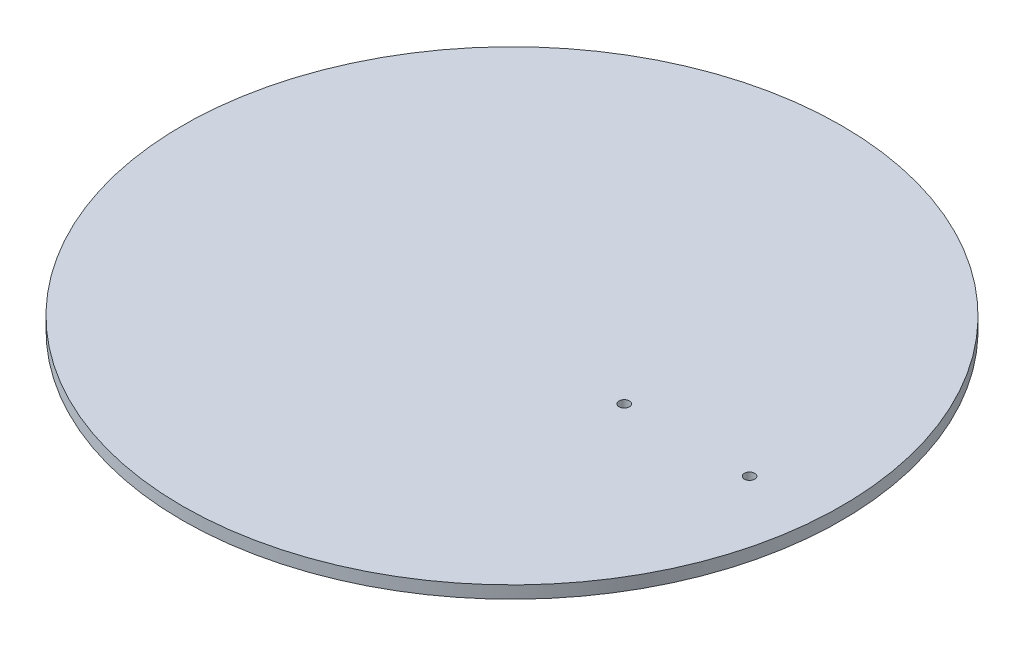
ISO-10303-21;
HEADER;
FILE_DESCRIPTION(('STEP AP214'),'2;1');
FILE_NAME('part.step','',(''),(''),'','','');
FILE_SCHEMA(('AUTOMOTIVE_DESIGN { 1 0 10303 214 1 1 1 1 }'));
ENDSEC;
DATA;
#1=APPLICATION_CONTEXT('core data for automotive mechanical design processes');
#2=APPLICATION_PROTOCOL_DEFINITION('international standard','automotive_design',2000,#1);
#3=PRODUCT_CONTEXT('',#1,'mechanical');
#4=PRODUCT('Part','Part','',(#3));
#5=PRODUCT_RELATED_PRODUCT_CATEGORY('part','',(#4));
#6=PRODUCT_DEFINITION_FORMATION('','',#4);
#7=PRODUCT_DEFINITION_CONTEXT('part definition',#1,'design');
#8=PRODUCT_DEFINITION('design','',#6,#7);
#9=PRODUCT_DEFINITION_SHAPE('','',#8);
#10=(LENGTH_UNIT() NAMED_UNIT(*) SI_UNIT(.MILLI.,.METRE.));
#11=(NAMED_UNIT(*) PLANE_ANGLE_UNIT() SI_UNIT($,.RADIAN.));
#12=(NAMED_UNIT(*) SI_UNIT($,.STERADIAN.) SOLID_ANGLE_UNIT());
#13=UNCERTAINTY_MEASURE_WITH_UNIT(LENGTH_MEASURE(1.E-05),#10,'distance_accuracy_value','');
#14=(GEOMETRIC_REPRESENTATION_CONTEXT(3) GLOBAL_UNCERTAINTY_ASSIGNED_CONTEXT((#13)) GLOBAL_UNIT_ASSIGNED_CONTEXT((#10,
#11,#12)) REPRESENTATION_CONTEXT('',''));
#15=CARTESIAN_POINT('',(0.,0.,0.));
#16=DIRECTION('',(0.,0.,1.));
#17=DIRECTION('',(1.,0.,0.));
#18=AXIS2_PLACEMENT_3D('',#15,#16,#17);
#19=CARTESIAN_POINT('',(40.7795689405013,2.54,74.952013207777));
#20=DIRECTION('',(0.,-1.,0.));
#21=DIRECTION('',(0.,0.,-1.));
#22=AXIS2_PLACEMENT_3D('',#19,#20,#21);
#23=CYLINDRICAL_SURFACE('',#22,1.05429477609715);
#24=CARTESIAN_POINT('',(40.7795689405013,2.54,74.952013207777));
#25=DIRECTION('',(0.,1.,0.));
#26=DIRECTION('',(0.,0.,1.));
#27=AXIS2_PLACEMENT_3D('',#24,#25,#26);
#28=CIRCLE('',#27,1.05429477609715);
#29=CARTESIAN_POINT('',(40.7795689405013,2.54,76.0063079838742));
#30=VERTEX_POINT('',#29);
#31=EDGE_CURVE('E41',#30,#30,#28,.T.);
#32=ORIENTED_EDGE('',*,*,#31,.T.);
#33=EDGE_LOOP('',(#32));
#34=FACE_BOUND('',#33,.T.);
#35=CARTESIAN_POINT('',(40.7795689405013,0.,74.952013207777));
#36=DIRECTION('',(0.,1.,0.));
#37=DIRECTION('',(0.,0.,1.));
#38=AXIS2_PLACEMENT_3D('',#35,#36,#37);
#39=CIRCLE('',#38,1.05429477609715);
#40=CARTESIAN_POINT('',(40.7795689405013,0.,76.0063079838742));
#41=VERTEX_POINT('',#40);
#42=EDGE_CURVE('E52',#41,#41,#39,.T.);
#43=ORIENTED_EDGE('',*,*,#42,.F.);
#44=EDGE_LOOP('',(#43));
#45=FACE_BOUND('',#44,.T.);
#46=ADVANCED_FACE('F33',(#34,#45),#23,.F.);
#47=CARTESIAN_POINT('',(66.3720586462217,2.54,74.952013207777));
#48=DIRECTION('',(0.,-1.,0.));
#49=DIRECTION('',(0.,0.,-1.));
#50=AXIS2_PLACEMENT_3D('',#47,#48,#49);
#51=CYLINDRICAL_SURFACE('',#50,1.05429477609715);
#52=CARTESIAN_POINT('',(66.3720586462217,2.54,74.952013207777));
#53=DIRECTION('',(0.,1.,0.));
#54=DIRECTION('',(0.,0.,1.));
#55=AXIS2_PLACEMENT_3D('',#52,#53,#54);
#56=CIRCLE('',#55,1.05429477609715);
#57=CARTESIAN_POINT('',(66.3720586462217,2.54,76.0063079838742));
#58=VERTEX_POINT('',#57);
#59=EDGE_CURVE('E46',#58,#58,#56,.T.);
#60=ORIENTED_EDGE('',*,*,#59,.T.);
#61=EDGE_LOOP('',(#60));
#62=FACE_BOUND('',#61,.T.);
#63=CARTESIAN_POINT('',(66.3720586462217,0.,74.952013207777));
#64=DIRECTION('',(0.,1.,0.));
#65=DIRECTION('',(0.,0.,1.));
#66=AXIS2_PLACEMENT_3D('',#63,#64,#65);
#67=CIRCLE('',#66,1.05429477609715);
#68=CARTESIAN_POINT('',(66.3720586462217,0.,76.0063079838742));
#69=VERTEX_POINT('',#68);
#70=EDGE_CURVE('E50',#69,#69,#67,.T.);
#71=ORIENTED_EDGE('',*,*,#70,.F.);
#72=EDGE_LOOP('',(#71));
#73=FACE_BOUND('',#72,.T.);
#74=ADVANCED_FACE('F35',(#62,#73),#51,.F.);
#75=CARTESIAN_POINT('',(13.7432890350295,2.54,70.8415877079415));
#76=DIRECTION('',(0.,-1.,0.));
#77=DIRECTION('',(0.,0.,-1.));
#78=AXIS2_PLACEMENT_3D('',#75,#76,#77);
#79=CYLINDRICAL_SURFACE('',#78,67.31);
#80=CARTESIAN_POINT('',(13.7432890350295,2.54,70.8415877079415));
#81=DIRECTION('',(0.,1.,0.));
#82=DIRECTION('',(0.,0.,1.));
#83=AXIS2_PLACEMENT_3D('',#80,#81,#82);
#84=CIRCLE('',#83,67.31);
#85=CARTESIAN_POINT('',(13.7432890350295,2.54,138.151587707942));
#86=VERTEX_POINT('',#85);
#87=EDGE_CURVE('E10',#86,#86,#84,.T.);
#88=ORIENTED_EDGE('',*,*,#87,.F.);
#89=EDGE_LOOP('',(#88));
#90=FACE_BOUND('',#89,.T.);
#91=CARTESIAN_POINT('',(13.7432890350295,0.,70.8415877079415));
#92=DIRECTION('',(0.,1.,0.));
#93=DIRECTION('',(0.,0.,1.));
#94=AXIS2_PLACEMENT_3D('',#91,#92,#93);
#95=CIRCLE('',#94,67.31);
#96=CARTESIAN_POINT('',(13.7432890350295,0.,138.151587707942));
#97=VERTEX_POINT('',#96);
#98=EDGE_CURVE('E37',#97,#97,#95,.T.);
#99=ORIENTED_EDGE('',*,*,#98,.T.);
#100=EDGE_LOOP('',(#99));
#101=FACE_BOUND('',#100,.T.);
#102=ADVANCED_FACE('F68',(#90,#101),#79,.T.);
#103=CARTESIAN_POINT('',(0.,2.54,0.));
#104=DIRECTION('',(0.,1.,0.));
#105=DIRECTION('',(0.,0.,1.));
#106=AXIS2_PLACEMENT_3D('',#103,#104,#105);
#107=PLANE('',#106);
#108=ORIENTED_EDGE('',*,*,#59,.F.);
#109=EDGE_LOOP('',(#108));
#110=FACE_BOUND('',#109,.T.);
#111=ORIENTED_EDGE('',*,*,#31,.F.);
#112=EDGE_LOOP('',(#111));
#113=FACE_BOUND('',#112,.T.);
#114=ORIENTED_EDGE('',*,*,#87,.T.);
#115=EDGE_LOOP('',(#114));
#116=FACE_BOUND('',#115,.T.);
#117=ADVANCED_FACE('F64',(#110,#113,#116),#107,.T.);
#118=CARTESIAN_POINT('',(0.,0.,0.));
#119=DIRECTION('',(0.,1.,0.));
#120=DIRECTION('',(0.,0.,1.));
#121=AXIS2_PLACEMENT_3D('',#118,#119,#120);
#122=PLANE('',#121);
#123=ORIENTED_EDGE('',*,*,#70,.T.);
#124=EDGE_LOOP('',(#123));
#125=FACE_BOUND('',#124,.T.);
#126=ORIENTED_EDGE('',*,*,#42,.T.);
#127=EDGE_LOOP('',(#126));
#128=FACE_BOUND('',#127,.T.);
#129=ORIENTED_EDGE('',*,*,#98,.F.);
#130=EDGE_LOOP('',(#129));
#131=FACE_BOUND('',#130,.T.);
#132=ADVANCED_FACE('F67',(#125,#128,#131),#122,.F.);
#133=CLOSED_SHELL('',(#46,#74,#102,#117,#132));
#134=MANIFOLD_SOLID_BREP('B2',#133);
#135=ADVANCED_BREP_SHAPE_REPRESENTATION('',(#18,#134),#14);
#136=SHAPE_DEFINITION_REPRESENTATION(#9,#135);
ENDSEC;
END-ISO-10303-21;
